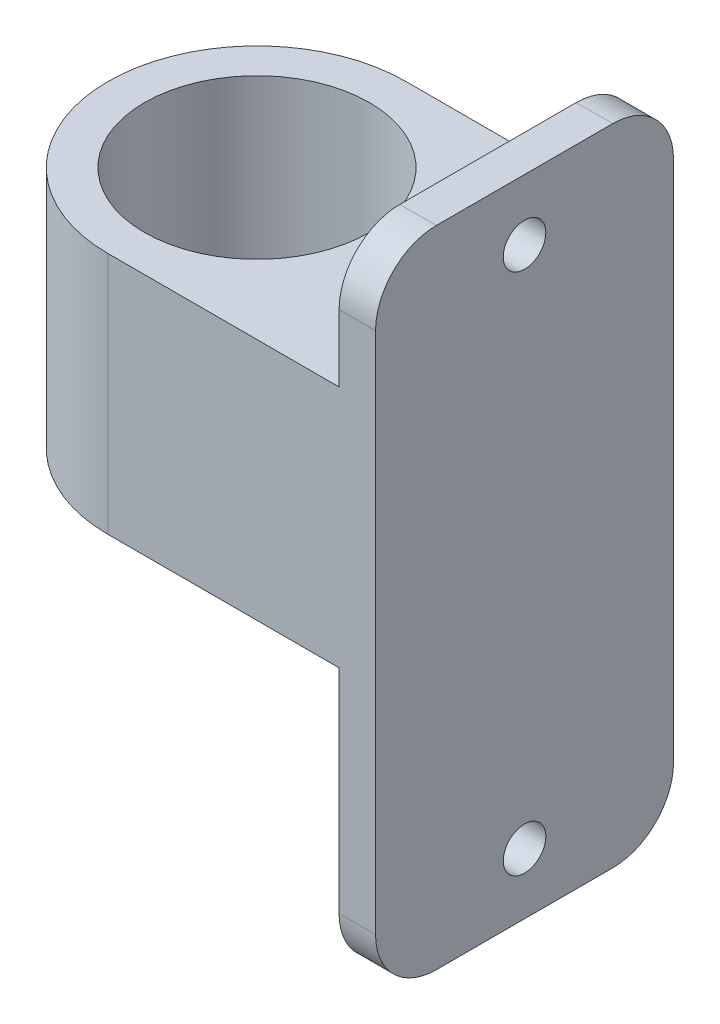
ISO-10303-21;
HEADER;
FILE_DESCRIPTION(('STEP AP214'),'2;1');
FILE_NAME('part.step','',(''),(''),'','','');
FILE_SCHEMA(('AUTOMOTIVE_DESIGN { 1 0 10303 214 1 1 1 1 }'));
ENDSEC;
DATA;
#1=APPLICATION_CONTEXT('core data for automotive mechanical design processes');
#2=APPLICATION_PROTOCOL_DEFINITION('international standard','automotive_design',2000,#1);
#3=PRODUCT_CONTEXT('',#1,'mechanical');
#4=PRODUCT('Part','Part','',(#3));
#5=PRODUCT_RELATED_PRODUCT_CATEGORY('part','',(#4));
#6=PRODUCT_DEFINITION_FORMATION('','',#4);
#7=PRODUCT_DEFINITION_CONTEXT('part definition',#1,'design');
#8=PRODUCT_DEFINITION('design','',#6,#7);
#9=PRODUCT_DEFINITION_SHAPE('','',#8);
#10=(LENGTH_UNIT() NAMED_UNIT(*) SI_UNIT(.MILLI.,.METRE.));
#11=(NAMED_UNIT(*) PLANE_ANGLE_UNIT() SI_UNIT($,.RADIAN.));
#12=(NAMED_UNIT(*) SI_UNIT($,.STERADIAN.) SOLID_ANGLE_UNIT());
#13=UNCERTAINTY_MEASURE_WITH_UNIT(LENGTH_MEASURE(1.E-05),#10,'distance_accuracy_value','');
#14=(GEOMETRIC_REPRESENTATION_CONTEXT(3) GLOBAL_UNCERTAINTY_ASSIGNED_CONTEXT((#13)) GLOBAL_UNIT_ASSIGNED_CONTEXT((#10,
#11,#12)) REPRESENTATION_CONTEXT('',''));
#15=CARTESIAN_POINT('',(0.,0.,0.));
#16=DIRECTION('',(0.,0.,1.));
#17=DIRECTION('',(1.,0.,0.));
#18=AXIS2_PLACEMENT_3D('',#15,#16,#17);
#19=CARTESIAN_POINT('',(0.,20.,0.));
#20=DIRECTION('',(0.,-1.,0.));
#21=DIRECTION('',(0.,0.,-1.));
#22=AXIS2_PLACEMENT_3D('',#19,#20,#21);
#23=CYLINDRICAL_SURFACE('',#22,12.25);
#24=CARTESIAN_POINT('',(0.,6.,0.));
#25=DIRECTION('',(0.,-1.,0.));
#26=DIRECTION('',(0.,0.,-1.));
#27=AXIS2_PLACEMENT_3D('',#24,#25,#26);
#28=CIRCLE('',#27,12.25);
#29=CARTESIAN_POINT('',(0.,6.,12.25));
#30=VERTEX_POINT('',#29);
#31=CARTESIAN_POINT('',(0.,6.,-12.25));
#32=VERTEX_POINT('',#31);
#33=EDGE_CURVE('E131',#30,#32,#28,.T.);
#34=ORIENTED_EDGE('',*,*,#33,.F.);
#35=DIRECTION('',(0.,-1.,0.));
#36=VECTOR('',#35,1.);
#37=CARTESIAN_POINT('',(0.,20.,12.25));
#38=LINE('',#37,#36);
#39=CARTESIAN_POINT('',(0.,26.,12.25));
#40=VERTEX_POINT('',#39);
#41=EDGE_CURVE('E172',#40,#30,#38,.T.);
#42=ORIENTED_EDGE('',*,*,#41,.F.);
#43=CARTESIAN_POINT('',(0.,26.,0.));
#44=DIRECTION('',(0.,1.,0.));
#45=DIRECTION('',(0.,0.,1.));
#46=AXIS2_PLACEMENT_3D('',#43,#44,#45);
#47=CIRCLE('',#46,12.25);
#48=CARTESIAN_POINT('',(0.,26.,-12.25));
#49=VERTEX_POINT('',#48);
#50=EDGE_CURVE('E154',#49,#40,#47,.T.);
#51=ORIENTED_EDGE('',*,*,#50,.F.);
#52=DIRECTION('',(0.,-1.,0.));
#53=VECTOR('',#52,1.);
#54=CARTESIAN_POINT('',(0.,20.,-12.25));
#55=LINE('',#54,#53);
#56=EDGE_CURVE('E145',#49,#32,#55,.T.);
#57=ORIENTED_EDGE('',*,*,#56,.T.);
#58=EDGE_LOOP('',(#34,#42,#51,#57));
#59=FACE_BOUND('',#58,.T.);
#60=ADVANCED_FACE('F41',(#59),#23,.T.);
#61=CARTESIAN_POINT('',(0.,20.,0.));
#62=DIRECTION('',(0.,-1.,0.));
#63=DIRECTION('',(0.,0.,-1.));
#64=AXIS2_PLACEMENT_3D('',#61,#62,#63);
#65=CYLINDRICAL_SURFACE('',#64,9.25);
#66=CARTESIAN_POINT('',(0.,26.,0.));
#67=DIRECTION('',(0.,1.,0.));
#68=DIRECTION('',(0.,0.,1.));
#69=AXIS2_PLACEMENT_3D('',#66,#67,#68);
#70=CIRCLE('',#69,9.25);
#71=CARTESIAN_POINT('',(0.,26.,9.25));
#72=VERTEX_POINT('',#71);
#73=EDGE_CURVE('E495',#72,#72,#70,.T.);
#74=ORIENTED_EDGE('',*,*,#73,.T.);
#75=EDGE_LOOP('',(#74));
#76=FACE_BOUND('',#75,.T.);
#77=CARTESIAN_POINT('',(0.,6.,0.));
#78=DIRECTION('',(0.,-1.,0.));
#79=DIRECTION('',(0.,0.,-1.));
#80=AXIS2_PLACEMENT_3D('',#77,#78,#79);
#81=CIRCLE('',#80,9.25);
#82=CARTESIAN_POINT('',(0.,6.,-9.25));
#83=VERTEX_POINT('',#82);
#84=EDGE_CURVE('E142',#83,#83,#81,.T.);
#85=ORIENTED_EDGE('',*,*,#84,.T.);
#86=EDGE_LOOP('',(#85));
#87=FACE_BOUND('',#86,.T.);
#88=ADVANCED_FACE('F316',(#76,#87),#65,.F.);
#89=CARTESIAN_POINT('',(0.,20.,12.25));
#90=DIRECTION('',(0.,0.,-1.));
#91=DIRECTION('',(-1.,0.,0.));
#92=AXIS2_PLACEMENT_3D('',#89,#90,#91);
#93=PLANE('',#92);
#94=DIRECTION('',(-1.,0.,0.));
#95=VECTOR('',#94,1.);
#96=CARTESIAN_POINT('',(19.,6.,12.25));
#97=LINE('',#96,#95);
#98=CARTESIAN_POINT('',(19.,6.,12.25));
#99=VERTEX_POINT('',#98);
#100=EDGE_CURVE('E137',#99,#30,#97,.T.);
#101=ORIENTED_EDGE('',*,*,#100,.F.);
#102=DIRECTION('',(0.,-1.,0.));
#103=VECTOR('',#102,1.);
#104=CARTESIAN_POINT('',(19.,0.,12.25));
#105=LINE('',#104,#103);
#106=CARTESIAN_POINT('',(19.,-11.5,12.25));
#107=VERTEX_POINT('',#106);
#108=EDGE_CURVE('E253',#99,#107,#105,.T.);
#109=ORIENTED_EDGE('',*,*,#108,.T.);
#110=DIRECTION('',(1.,0.,0.));
#111=VECTOR('',#110,1.);
#112=CARTESIAN_POINT('',(22.,-11.5,12.25));
#113=LINE('',#112,#111);
#114=CARTESIAN_POINT('',(22.,-11.5,12.25));
#115=VERTEX_POINT('',#114);
#116=EDGE_CURVE('E210',#107,#115,#113,.T.);
#117=ORIENTED_EDGE('',*,*,#116,.T.);
#118=DIRECTION('',(0.,-1.,0.));
#119=VECTOR('',#118,1.);
#120=CARTESIAN_POINT('',(22.,20.,12.25));
#121=LINE('',#120,#119);
#122=CARTESIAN_POINT('',(22.,31.5,12.25));
#123=VERTEX_POINT('',#122);
#124=EDGE_CURVE('E162',#123,#115,#121,.T.);
#125=ORIENTED_EDGE('',*,*,#124,.F.);
#126=DIRECTION('',(1.,0.,0.));
#127=VECTOR('',#126,1.);
#128=CARTESIAN_POINT('',(19.,31.5,12.25));
#129=LINE('',#128,#127);
#130=CARTESIAN_POINT('',(19.,31.5,12.25));
#131=VERTEX_POINT('',#130);
#132=EDGE_CURVE('E207',#123,#131,#129,.F.);
#133=ORIENTED_EDGE('',*,*,#132,.T.);
#134=DIRECTION('',(0.,-1.,0.));
#135=VECTOR('',#134,1.);
#136=CARTESIAN_POINT('',(19.,20.,12.25));
#137=LINE('',#136,#135);
#138=CARTESIAN_POINT('',(19.,26.,12.25));
#139=VERTEX_POINT('',#138);
#140=EDGE_CURVE('E273',#131,#139,#137,.T.);
#141=ORIENTED_EDGE('',*,*,#140,.T.);
#142=DIRECTION('',(1.,0.,0.));
#143=VECTOR('',#142,1.);
#144=CARTESIAN_POINT('',(0.,26.,12.25));
#145=LINE('',#144,#143);
#146=EDGE_CURVE('E292',#40,#139,#145,.T.);
#147=ORIENTED_EDGE('',*,*,#146,.F.);
#148=ORIENTED_EDGE('',*,*,#41,.T.);
#149=EDGE_LOOP('',(#101,#109,#117,#125,#133,#141,#147,#148));
#150=FACE_BOUND('',#149,.T.);
#151=ADVANCED_FACE('F287',(#150),#93,.F.);
#152=CARTESIAN_POINT('',(22.,20.,0.));
#153=DIRECTION('',(-1.,0.,0.));
#154=DIRECTION('',(0.,0.,1.));
#155=AXIS2_PLACEMENT_3D('',#152,#153,#154);
#156=PLANE('',#155);
#157=DIRECTION('',(0.,0.,-1.));
#158=VECTOR('',#157,1.);
#159=CARTESIAN_POINT('',(22.,-16.5,12.25));
#160=LINE('',#159,#158);
#161=CARTESIAN_POINT('',(22.,-16.5,7.25));
#162=VERTEX_POINT('',#161);
#163=CARTESIAN_POINT('',(22.,-16.5,-7.25));
#164=VERTEX_POINT('',#163);
#165=EDGE_CURVE('E239',#162,#164,#160,.T.);
#166=ORIENTED_EDGE('',*,*,#165,.T.);
#167=CARTESIAN_POINT('',(22.,-11.5,-7.25));
#168=DIRECTION('',(-1.,0.,0.));
#169=DIRECTION('',(0.,0.,1.));
#170=AXIS2_PLACEMENT_3D('',#167,#168,#169);
#171=CIRCLE('',#170,5.);
#172=CARTESIAN_POINT('',(22.,-11.5,-12.25));
#173=VERTEX_POINT('',#172);
#174=EDGE_CURVE('E191',#164,#173,#171,.F.);
#175=ORIENTED_EDGE('',*,*,#174,.T.);
#176=DIRECTION('',(0.,-1.,0.));
#177=VECTOR('',#176,1.);
#178=CARTESIAN_POINT('',(22.,20.,-12.25));
#179=LINE('',#178,#177);
#180=CARTESIAN_POINT('',(22.,31.5,-12.25));
#181=VERTEX_POINT('',#180);
#182=EDGE_CURVE('E156',#181,#173,#179,.T.);
#183=ORIENTED_EDGE('',*,*,#182,.F.);
#184=CARTESIAN_POINT('',(22.,31.5,-7.25));
#185=DIRECTION('',(-1.,0.,0.));
#186=DIRECTION('',(0.,0.,1.));
#187=AXIS2_PLACEMENT_3D('',#184,#185,#186);
#188=CIRCLE('',#187,5.);
#189=CARTESIAN_POINT('',(22.,36.5,-7.25));
#190=VERTEX_POINT('',#189);
#191=EDGE_CURVE('E182',#181,#190,#188,.F.);
#192=ORIENTED_EDGE('',*,*,#191,.T.);
#193=DIRECTION('',(0.,0.,1.));
#194=VECTOR('',#193,1.);
#195=CARTESIAN_POINT('',(22.,36.5,12.25));
#196=LINE('',#195,#194);
#197=CARTESIAN_POINT('',(22.,36.5,7.25));
#198=VERTEX_POINT('',#197);
#199=EDGE_CURVE('E167',#190,#198,#196,.T.);
#200=ORIENTED_EDGE('',*,*,#199,.T.);
#201=CARTESIAN_POINT('',(22.,31.5,7.25));
#202=DIRECTION('',(-1.,0.,0.));
#203=DIRECTION('',(0.,0.,1.));
#204=AXIS2_PLACEMENT_3D('',#201,#202,#203);
#205=CIRCLE('',#204,5.);
#206=EDGE_CURVE('E185',#198,#123,#205,.F.);
#207=ORIENTED_EDGE('',*,*,#206,.T.);
#208=ORIENTED_EDGE('',*,*,#124,.T.);
#209=CARTESIAN_POINT('',(22.,-11.5,7.25));
#210=DIRECTION('',(-1.,0.,0.));
#211=DIRECTION('',(0.,0.,1.));
#212=AXIS2_PLACEMENT_3D('',#209,#210,#211);
#213=CIRCLE('',#212,5.);
#214=EDGE_CURVE('E188',#115,#162,#213,.F.);
#215=ORIENTED_EDGE('',*,*,#214,.T.);
#216=EDGE_LOOP('',(#166,#175,#183,#192,#200,#207,#208,#215));
#217=FACE_BOUND('',#216,.T.);
#218=CARTESIAN_POINT('',(22.,31.5,0.));
#219=DIRECTION('',(1.,0.,0.));
#220=DIRECTION('',(0.,0.,-1.));
#221=AXIS2_PLACEMENT_3D('',#218,#219,#220);
#222=CIRCLE('',#221,1.75);
#223=CARTESIAN_POINT('',(22.,31.5,-1.75));
#224=VERTEX_POINT('',#223);
#225=EDGE_CURVE('E257',#224,#224,#222,.T.);
#226=ORIENTED_EDGE('',*,*,#225,.F.);
#227=EDGE_LOOP('',(#226));
#228=FACE_BOUND('',#227,.T.);
#229=CARTESIAN_POINT('',(22.,-11.5,0.));
#230=DIRECTION('',(1.,0.,0.));
#231=DIRECTION('',(0.,0.,1.));
#232=AXIS2_PLACEMENT_3D('',#229,#230,#231);
#233=CIRCLE('',#232,1.75);
#234=CARTESIAN_POINT('',(22.,-11.5,1.75));
#235=VERTEX_POINT('',#234);
#236=EDGE_CURVE('E296',#235,#235,#233,.T.);
#237=ORIENTED_EDGE('',*,*,#236,.F.);
#238=EDGE_LOOP('',(#237));
#239=FACE_BOUND('',#238,.T.);
#240=ADVANCED_FACE('F234',(#217,#228,#239),#156,.F.);
#241=CARTESIAN_POINT('',(0.,20.,-12.25));
#242=DIRECTION('',(0.,0.,-1.));
#243=DIRECTION('',(-1.,0.,0.));
#244=AXIS2_PLACEMENT_3D('',#241,#242,#243);
#245=PLANE('',#244);
#246=DIRECTION('',(0.,1.,0.));
#247=VECTOR('',#246,1.);
#248=CARTESIAN_POINT('',(19.,0.,-12.25));
#249=LINE('',#248,#247);
#250=CARTESIAN_POINT('',(19.,-11.5,-12.25));
#251=VERTEX_POINT('',#250);
#252=CARTESIAN_POINT('',(19.,6.,-12.25));
#253=VERTEX_POINT('',#252);
#254=EDGE_CURVE('E147',#251,#253,#249,.T.);
#255=ORIENTED_EDGE('',*,*,#254,.T.);
#256=DIRECTION('',(1.,0.,0.));
#257=VECTOR('',#256,1.);
#258=CARTESIAN_POINT('',(0.,6.,-12.25));
#259=LINE('',#258,#257);
#260=EDGE_CURVE('E135',#32,#253,#259,.T.);
#261=ORIENTED_EDGE('',*,*,#260,.F.);
#262=ORIENTED_EDGE('',*,*,#56,.F.);
#263=DIRECTION('',(-1.,0.,0.));
#264=VECTOR('',#263,1.);
#265=CARTESIAN_POINT('',(19.,26.,-12.25));
#266=LINE('',#265,#264);
#267=CARTESIAN_POINT('',(19.,26.,-12.25));
#268=VERTEX_POINT('',#267);
#269=EDGE_CURVE('E57',#268,#49,#266,.T.);
#270=ORIENTED_EDGE('',*,*,#269,.F.);
#271=DIRECTION('',(0.,1.,0.));
#272=VECTOR('',#271,1.);
#273=CARTESIAN_POINT('',(19.,20.,-12.25));
#274=LINE('',#273,#272);
#275=CARTESIAN_POINT('',(19.,31.5,-12.25));
#276=VERTEX_POINT('',#275);
#277=EDGE_CURVE('E164',#268,#276,#274,.T.);
#278=ORIENTED_EDGE('',*,*,#277,.T.);
#279=DIRECTION('',(1.,0.,0.));
#280=VECTOR('',#279,1.);
#281=CARTESIAN_POINT('',(0.,31.5,-12.25));
#282=LINE('',#281,#280);
#283=EDGE_CURVE('E194',#276,#181,#282,.T.);
#284=ORIENTED_EDGE('',*,*,#283,.T.);
#285=ORIENTED_EDGE('',*,*,#182,.T.);
#286=DIRECTION('',(1.,0.,0.));
#287=VECTOR('',#286,1.);
#288=CARTESIAN_POINT('',(0.,-11.5,-12.25));
#289=LINE('',#288,#287);
#290=EDGE_CURVE('E198',#173,#251,#289,.F.);
#291=ORIENTED_EDGE('',*,*,#290,.T.);
#292=EDGE_LOOP('',(#255,#261,#262,#270,#278,#284,#285,#291));
#293=FACE_BOUND('',#292,.T.);
#294=ADVANCED_FACE('F144',(#293),#245,.T.);
#295=CARTESIAN_POINT('',(19.,36.5,12.25));
#296=DIRECTION('',(0.,1.,0.));
#297=DIRECTION('',(0.,0.,1.));
#298=AXIS2_PLACEMENT_3D('',#295,#296,#297);
#299=PLANE('',#298);
#300=DIRECTION('',(0.,0.,1.));
#301=VECTOR('',#300,1.);
#302=CARTESIAN_POINT('',(19.,36.5,12.25));
#303=LINE('',#302,#301);
#304=CARTESIAN_POINT('',(19.,36.5,-7.25));
#305=VERTEX_POINT('',#304);
#306=CARTESIAN_POINT('',(19.,36.5,7.25));
#307=VERTEX_POINT('',#306);
#308=EDGE_CURVE('E157',#305,#307,#303,.T.);
#309=ORIENTED_EDGE('',*,*,#308,.T.);
#310=DIRECTION('',(1.,0.,0.));
#311=VECTOR('',#310,1.);
#312=CARTESIAN_POINT('',(22.,36.5,7.25));
#313=LINE('',#312,#311);
#314=EDGE_CURVE('E217',#307,#198,#313,.T.);
#315=ORIENTED_EDGE('',*,*,#314,.T.);
#316=ORIENTED_EDGE('',*,*,#199,.F.);
#317=DIRECTION('',(1.,0.,0.));
#318=VECTOR('',#317,1.);
#319=CARTESIAN_POINT('',(19.,36.5,-7.25));
#320=LINE('',#319,#318);
#321=EDGE_CURVE('E214',#190,#305,#320,.F.);
#322=ORIENTED_EDGE('',*,*,#321,.T.);
#323=EDGE_LOOP('',(#309,#315,#316,#322));
#324=FACE_BOUND('',#323,.T.);
#325=ADVANCED_FACE('F281',(#324),#299,.T.);
#326=CARTESIAN_POINT('',(19.,0.,0.));
#327=DIRECTION('',(-1.,0.,0.));
#328=DIRECTION('',(0.,0.,1.));
#329=AXIS2_PLACEMENT_3D('',#326,#327,#328);
#330=PLANE('',#329);
#331=DIRECTION('',(0.,0.,-1.));
#332=VECTOR('',#331,1.);
#333=CARTESIAN_POINT('',(19.,26.,12.25));
#334=LINE('',#333,#332);
#335=EDGE_CURVE('E289',#139,#268,#334,.T.);
#336=ORIENTED_EDGE('',*,*,#335,.F.);
#337=ORIENTED_EDGE('',*,*,#140,.F.);
#338=CARTESIAN_POINT('',(19.,31.5,7.25));
#339=DIRECTION('',(-1.,0.,0.));
#340=DIRECTION('',(0.,0.,1.));
#341=AXIS2_PLACEMENT_3D('',#338,#339,#340);
#342=CIRCLE('',#341,5.);
#343=EDGE_CURVE('E11',#131,#307,#342,.T.);
#344=ORIENTED_EDGE('',*,*,#343,.T.);
#345=ORIENTED_EDGE('',*,*,#308,.F.);
#346=CARTESIAN_POINT('',(19.,31.5,-7.25));
#347=DIRECTION('',(-1.,0.,0.));
#348=DIRECTION('',(0.,0.,1.));
#349=AXIS2_PLACEMENT_3D('',#346,#347,#348);
#350=CIRCLE('',#349,5.);
#351=EDGE_CURVE('E50',#305,#276,#350,.T.);
#352=ORIENTED_EDGE('',*,*,#351,.T.);
#353=ORIENTED_EDGE('',*,*,#277,.F.);
#354=EDGE_LOOP('',(#336,#337,#344,#345,#352,#353));
#355=FACE_BOUND('',#354,.T.);
#356=CARTESIAN_POINT('',(19.,31.5,0.));
#357=DIRECTION('',(1.,0.,0.));
#358=DIRECTION('',(0.,0.,-1.));
#359=AXIS2_PLACEMENT_3D('',#356,#357,#358);
#360=CIRCLE('',#359,1.75);
#361=CARTESIAN_POINT('',(19.,31.5,-1.75));
#362=VERTEX_POINT('',#361);
#363=EDGE_CURVE('E266',#362,#362,#360,.T.);
#364=ORIENTED_EDGE('',*,*,#363,.T.);
#365=EDGE_LOOP('',(#364));
#366=FACE_BOUND('',#365,.T.);
#367=ADVANCED_FACE('F226',(#355,#366),#330,.T.);
#368=CARTESIAN_POINT('',(19.,31.5,0.));
#369=DIRECTION('',(1.,0.,0.));
#370=DIRECTION('',(0.,0.,-1.));
#371=AXIS2_PLACEMENT_3D('',#368,#369,#370);
#372=CYLINDRICAL_SURFACE('',#371,1.75);
#373=ORIENTED_EDGE('',*,*,#363,.F.);
#374=EDGE_LOOP('',(#373));
#375=FACE_BOUND('',#374,.T.);
#376=ORIENTED_EDGE('',*,*,#225,.T.);
#377=EDGE_LOOP('',(#376));
#378=FACE_BOUND('',#377,.T.);
#379=ADVANCED_FACE('F356',(#375,#378),#372,.F.);
#380=CARTESIAN_POINT('',(19.,-16.5,12.25));
#381=DIRECTION('',(0.,-1.,0.));
#382=DIRECTION('',(0.,0.,-1.));
#383=AXIS2_PLACEMENT_3D('',#380,#381,#382);
#384=PLANE('',#383);
#385=DIRECTION('',(0.,0.,-1.));
#386=VECTOR('',#385,1.);
#387=CARTESIAN_POINT('',(19.,-16.5,12.25));
#388=LINE('',#387,#386);
#389=CARTESIAN_POINT('',(19.,-16.5,7.25));
#390=VERTEX_POINT('',#389);
#391=CARTESIAN_POINT('',(19.,-16.5,-7.25));
#392=VERTEX_POINT('',#391);
#393=EDGE_CURVE('E249',#390,#392,#388,.T.);
#394=ORIENTED_EDGE('',*,*,#393,.T.);
#395=DIRECTION('',(1.,0.,0.));
#396=VECTOR('',#395,1.);
#397=CARTESIAN_POINT('',(19.,-16.5,-7.25));
#398=LINE('',#397,#396);
#399=EDGE_CURVE('E178',#392,#164,#398,.T.);
#400=ORIENTED_EDGE('',*,*,#399,.T.);
#401=ORIENTED_EDGE('',*,*,#165,.F.);
#402=DIRECTION('',(1.,0.,0.));
#403=VECTOR('',#402,1.);
#404=CARTESIAN_POINT('',(19.,-16.5,7.25));
#405=LINE('',#404,#403);
#406=EDGE_CURVE('E175',#162,#390,#405,.F.);
#407=ORIENTED_EDGE('',*,*,#406,.T.);
#408=EDGE_LOOP('',(#394,#400,#401,#407));
#409=FACE_BOUND('',#408,.T.);
#410=ADVANCED_FACE('F246',(#409),#384,.T.);
#411=CARTESIAN_POINT('',(19.,0.,0.));
#412=DIRECTION('',(-1.,0.,0.));
#413=DIRECTION('',(0.,0.,1.));
#414=AXIS2_PLACEMENT_3D('',#411,#412,#413);
#415=PLANE('',#414);
#416=CARTESIAN_POINT('',(19.,-11.5,0.));
#417=DIRECTION('',(1.,0.,0.));
#418=DIRECTION('',(0.,0.,1.));
#419=AXIS2_PLACEMENT_3D('',#416,#417,#418);
#420=CIRCLE('',#419,1.75);
#421=CARTESIAN_POINT('',(19.,-11.5,1.75));
#422=VERTEX_POINT('',#421);
#423=EDGE_CURVE('E265',#422,#422,#420,.T.);
#424=ORIENTED_EDGE('',*,*,#423,.T.);
#425=EDGE_LOOP('',(#424));
#426=FACE_BOUND('',#425,.T.);
#427=ORIENTED_EDGE('',*,*,#254,.F.);
#428=CARTESIAN_POINT('',(19.,-11.5,-7.25));
#429=DIRECTION('',(-1.,0.,0.));
#430=DIRECTION('',(0.,0.,1.));
#431=AXIS2_PLACEMENT_3D('',#428,#429,#430);
#432=CIRCLE('',#431,5.);
#433=EDGE_CURVE('E204',#251,#392,#432,.T.);
#434=ORIENTED_EDGE('',*,*,#433,.T.);
#435=ORIENTED_EDGE('',*,*,#393,.F.);
#436=CARTESIAN_POINT('',(19.,-11.5,7.25));
#437=DIRECTION('',(-1.,0.,0.));
#438=DIRECTION('',(0.,0.,1.));
#439=AXIS2_PLACEMENT_3D('',#436,#437,#438);
#440=CIRCLE('',#439,5.);
#441=EDGE_CURVE('E201',#390,#107,#440,.T.);
#442=ORIENTED_EDGE('',*,*,#441,.T.);
#443=ORIENTED_EDGE('',*,*,#108,.F.);
#444=DIRECTION('',(0.,0.,1.));
#445=VECTOR('',#444,1.);
#446=CARTESIAN_POINT('',(19.,6.,-12.25));
#447=LINE('',#446,#445);
#448=EDGE_CURVE('E150',#253,#99,#447,.T.);
#449=ORIENTED_EDGE('',*,*,#448,.F.);
#450=EDGE_LOOP('',(#427,#434,#435,#442,#443,#449));
#451=FACE_BOUND('',#450,.T.);
#452=ADVANCED_FACE('F349',(#426,#451),#415,.T.);
#453=CARTESIAN_POINT('',(19.,-11.5,0.));
#454=DIRECTION('',(1.,0.,0.));
#455=DIRECTION('',(0.,0.,-1.));
#456=AXIS2_PLACEMENT_3D('',#453,#454,#455);
#457=CYLINDRICAL_SURFACE('',#456,1.75);
#458=ORIENTED_EDGE('',*,*,#423,.F.);
#459=EDGE_LOOP('',(#458));
#460=FACE_BOUND('',#459,.T.);
#461=ORIENTED_EDGE('',*,*,#236,.T.);
#462=EDGE_LOOP('',(#461));
#463=FACE_BOUND('',#462,.T.);
#464=ADVANCED_FACE('F307',(#460,#463),#457,.F.);
#465=CARTESIAN_POINT('',(19.,-11.5,-7.25));
#466=DIRECTION('',(1.,0.,0.));
#467=DIRECTION('',(0.,0.,-1.));
#468=AXIS2_PLACEMENT_3D('',#465,#466,#467);
#469=CYLINDRICAL_SURFACE('',#468,5.);
#470=ORIENTED_EDGE('',*,*,#433,.F.);
#471=ORIENTED_EDGE('',*,*,#290,.F.);
#472=ORIENTED_EDGE('',*,*,#174,.F.);
#473=ORIENTED_EDGE('',*,*,#399,.F.);
#474=EDGE_LOOP('',(#470,#471,#472,#473));
#475=FACE_BOUND('',#474,.T.);
#476=ADVANCED_FACE('F243',(#475),#469,.T.);
#477=CARTESIAN_POINT('',(0.,-11.5,7.25));
#478=DIRECTION('',(-1.,0.,0.));
#479=DIRECTION('',(0.,0.,1.));
#480=AXIS2_PLACEMENT_3D('',#477,#478,#479);
#481=CYLINDRICAL_SURFACE('',#480,5.);
#482=ORIENTED_EDGE('',*,*,#441,.F.);
#483=ORIENTED_EDGE('',*,*,#406,.F.);
#484=ORIENTED_EDGE('',*,*,#214,.F.);
#485=ORIENTED_EDGE('',*,*,#116,.F.);
#486=EDGE_LOOP('',(#482,#483,#484,#485));
#487=FACE_BOUND('',#486,.T.);
#488=ADVANCED_FACE('F328',(#487),#481,.T.);
#489=CARTESIAN_POINT('',(19.,31.5,7.25));
#490=DIRECTION('',(-1.,0.,0.));
#491=DIRECTION('',(0.,0.,1.));
#492=AXIS2_PLACEMENT_3D('',#489,#490,#491);
#493=CYLINDRICAL_SURFACE('',#492,5.);
#494=ORIENTED_EDGE('',*,*,#343,.F.);
#495=ORIENTED_EDGE('',*,*,#132,.F.);
#496=ORIENTED_EDGE('',*,*,#206,.F.);
#497=ORIENTED_EDGE('',*,*,#314,.F.);
#498=EDGE_LOOP('',(#494,#495,#496,#497));
#499=FACE_BOUND('',#498,.T.);
#500=ADVANCED_FACE('F284',(#499),#493,.T.);
#501=CARTESIAN_POINT('',(0.,31.5,-7.25));
#502=DIRECTION('',(1.,0.,0.));
#503=DIRECTION('',(0.,0.,-1.));
#504=AXIS2_PLACEMENT_3D('',#501,#502,#503);
#505=CYLINDRICAL_SURFACE('',#504,5.);
#506=ORIENTED_EDGE('',*,*,#351,.F.);
#507=ORIENTED_EDGE('',*,*,#321,.F.);
#508=ORIENTED_EDGE('',*,*,#191,.F.);
#509=ORIENTED_EDGE('',*,*,#283,.F.);
#510=EDGE_LOOP('',(#506,#507,#508,#509));
#511=FACE_BOUND('',#510,.T.);
#512=ADVANCED_FACE('F43',(#511),#505,.T.);
#513=CARTESIAN_POINT('',(0.,26.,0.));
#514=DIRECTION('',(0.,1.,0.));
#515=DIRECTION('',(0.,0.,1.));
#516=AXIS2_PLACEMENT_3D('',#513,#514,#515);
#517=PLANE('',#516);
#518=ORIENTED_EDGE('',*,*,#50,.T.);
#519=ORIENTED_EDGE('',*,*,#146,.T.);
#520=ORIENTED_EDGE('',*,*,#335,.T.);
#521=ORIENTED_EDGE('',*,*,#269,.T.);
#522=EDGE_LOOP('',(#518,#519,#520,#521));
#523=FACE_BOUND('',#522,.T.);
#524=ORIENTED_EDGE('',*,*,#73,.F.);
#525=EDGE_LOOP('',(#524));
#526=FACE_BOUND('',#525,.T.);
#527=ADVANCED_FACE('F335',(#523,#526),#517,.T.);
#528=CARTESIAN_POINT('',(0.,6.,0.));
#529=DIRECTION('',(0.,-1.,0.));
#530=DIRECTION('',(0.,0.,-1.));
#531=AXIS2_PLACEMENT_3D('',#528,#529,#530);
#532=PLANE('',#531);
#533=ORIENTED_EDGE('',*,*,#84,.F.);
#534=EDGE_LOOP('',(#533));
#535=FACE_BOUND('',#534,.T.);
#536=ORIENTED_EDGE('',*,*,#33,.T.);
#537=ORIENTED_EDGE('',*,*,#260,.T.);
#538=ORIENTED_EDGE('',*,*,#448,.T.);
#539=ORIENTED_EDGE('',*,*,#100,.T.);
#540=EDGE_LOOP('',(#536,#537,#538,#539));
#541=FACE_BOUND('',#540,.T.);
#542=ADVANCED_FACE('F133',(#535,#541),#532,.T.);
#543=CLOSED_SHELL('',(#60,#88,#151,#240,#294,#325,#367,#379,#410,#452,#464,#476,#488,#500,#512,
#527,#542));
#544=MANIFOLD_SOLID_BREP('B2',#543);
#545=ADVANCED_BREP_SHAPE_REPRESENTATION('',(#18,#544),#14);
#546=SHAPE_DEFINITION_REPRESENTATION(#9,#545);
ENDSEC;
END-ISO-10303-21;
